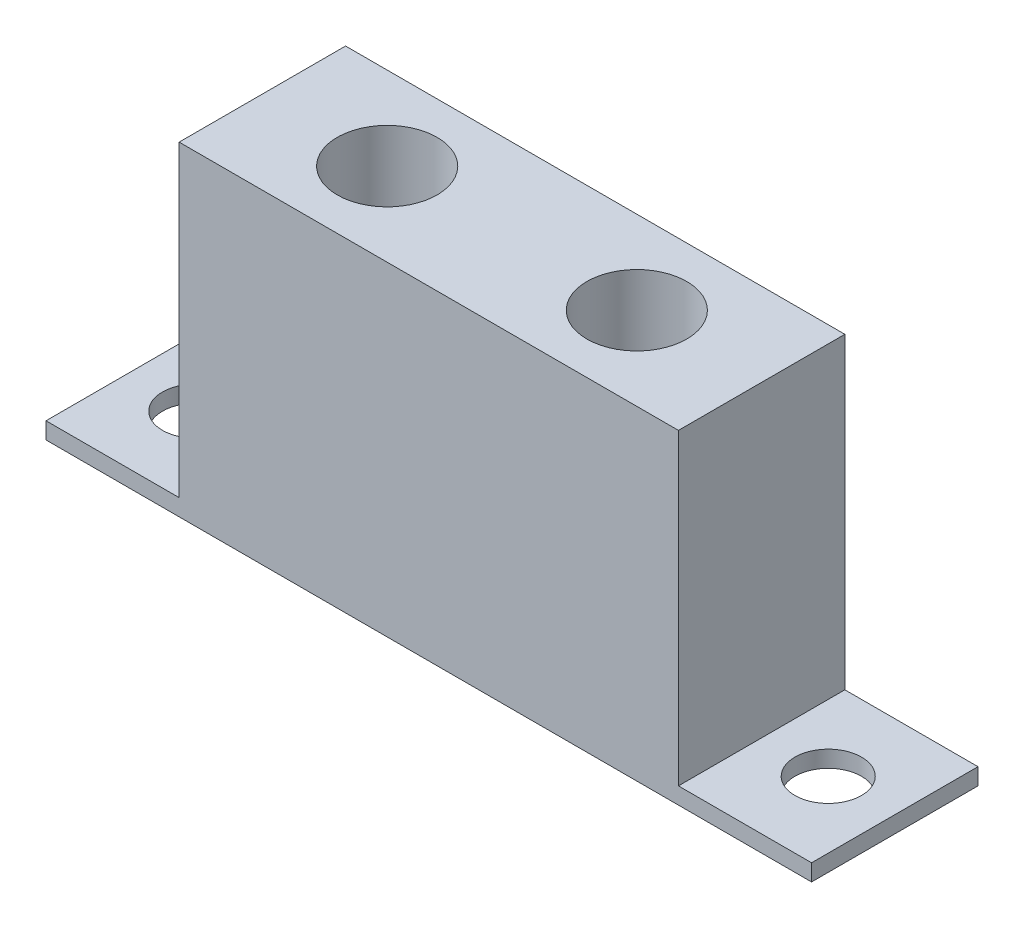
ISO-10303-21;
HEADER;
FILE_DESCRIPTION(('STEP AP214'),'2;1');
FILE_NAME('part.step','',(''),(''),'','','');
FILE_SCHEMA(('AUTOMOTIVE_DESIGN { 1 0 10303 214 1 1 1 1 }'));
ENDSEC;
DATA;
#1=APPLICATION_CONTEXT('core data for automotive mechanical design processes');
#2=APPLICATION_PROTOCOL_DEFINITION('international standard','automotive_design',2000,#1);
#3=PRODUCT_CONTEXT('',#1,'mechanical');
#4=PRODUCT('Part','Part','',(#3));
#5=PRODUCT_RELATED_PRODUCT_CATEGORY('part','',(#4));
#6=PRODUCT_DEFINITION_FORMATION('','',#4);
#7=PRODUCT_DEFINITION_CONTEXT('part definition',#1,'design');
#8=PRODUCT_DEFINITION('design','',#6,#7);
#9=PRODUCT_DEFINITION_SHAPE('','',#8);
#10=(LENGTH_UNIT() NAMED_UNIT(*) SI_UNIT(.MILLI.,.METRE.));
#11=(NAMED_UNIT(*) PLANE_ANGLE_UNIT() SI_UNIT($,.RADIAN.));
#12=(NAMED_UNIT(*) SI_UNIT($,.STERADIAN.) SOLID_ANGLE_UNIT());
#13=UNCERTAINTY_MEASURE_WITH_UNIT(LENGTH_MEASURE(1.E-05),#10,'distance_accuracy_value','');
#14=(GEOMETRIC_REPRESENTATION_CONTEXT(3) GLOBAL_UNCERTAINTY_ASSIGNED_CONTEXT((#13)) GLOBAL_UNIT_ASSIGNED_CONTEXT((#10,
#11,#12)) REPRESENTATION_CONTEXT('',''));
#15=CARTESIAN_POINT('',(0.,0.,0.));
#16=DIRECTION('',(0.,0.,1.));
#17=DIRECTION('',(1.,0.,0.));
#18=AXIS2_PLACEMENT_3D('',#15,#16,#17);
#19=CARTESIAN_POINT('',(-7.84172661870503,9.75,2.5));
#20=DIRECTION('',(1.,0.,0.));
#21=DIRECTION('',(0.,0.,-1.));
#22=AXIS2_PLACEMENT_3D('',#19,#20,#21);
#23=PLANE('',#22);
#24=DIRECTION('',(0.,0.,-1.));
#25=VECTOR('',#24,1.);
#26=CARTESIAN_POINT('',(-7.84172661870503,0.5,-2.5));
#27=LINE('',#26,#25);
#28=CARTESIAN_POINT('',(-7.84172661870503,0.5,2.5));
#29=VERTEX_POINT('',#28);
#30=CARTESIAN_POINT('',(-7.84172661870503,0.5,-2.5));
#31=VERTEX_POINT('',#30);
#32=EDGE_CURVE('E58',#29,#31,#27,.T.);
#33=ORIENTED_EDGE('',*,*,#32,.F.);
#34=DIRECTION('',(0.,-1.,0.));
#35=VECTOR('',#34,1.);
#36=CARTESIAN_POINT('',(-7.84172661870503,9.75,2.5));
#37=LINE('',#36,#35);
#38=CARTESIAN_POINT('',(-7.84172661870503,9.75,2.5));
#39=VERTEX_POINT('',#38);
#40=EDGE_CURVE('E185',#39,#29,#37,.T.);
#41=ORIENTED_EDGE('',*,*,#40,.F.);
#42=DIRECTION('',(0.,0.,1.));
#43=VECTOR('',#42,1.);
#44=CARTESIAN_POINT('',(-7.84172661870503,9.75,2.5));
#45=LINE('',#44,#43);
#46=CARTESIAN_POINT('',(-7.84172661870503,9.75,-2.5));
#47=VERTEX_POINT('',#46);
#48=EDGE_CURVE('E178',#47,#39,#45,.T.);
#49=ORIENTED_EDGE('',*,*,#48,.F.);
#50=DIRECTION('',(0.,-1.,0.));
#51=VECTOR('',#50,1.);
#52=CARTESIAN_POINT('',(-7.84172661870503,9.75,-2.5));
#53=LINE('',#52,#51);
#54=EDGE_CURVE('E51',#47,#31,#53,.T.);
#55=ORIENTED_EDGE('',*,*,#54,.T.);
#56=EDGE_LOOP('',(#33,#41,#49,#55));
#57=FACE_BOUND('',#56,.T.);
#58=ADVANCED_FACE('F43',(#57),#23,.F.);
#59=CARTESIAN_POINT('',(7.15827338129497,9.75,2.5));
#60=DIRECTION('',(-1.,0.,0.));
#61=DIRECTION('',(0.,0.,1.));
#62=AXIS2_PLACEMENT_3D('',#59,#60,#61);
#63=PLANE('',#62);
#64=DIRECTION('',(0.,0.,1.));
#65=VECTOR('',#64,1.);
#66=CARTESIAN_POINT('',(7.15827338129497,0.5,2.5));
#67=LINE('',#66,#65);
#68=CARTESIAN_POINT('',(7.15827338129497,0.5,-2.5));
#69=VERTEX_POINT('',#68);
#70=CARTESIAN_POINT('',(7.15827338129497,0.5,2.5));
#71=VERTEX_POINT('',#70);
#72=EDGE_CURVE('E66',#69,#71,#67,.T.);
#73=ORIENTED_EDGE('',*,*,#72,.F.);
#74=DIRECTION('',(0.,-1.,0.));
#75=VECTOR('',#74,1.);
#76=CARTESIAN_POINT('',(7.15827338129497,9.75,-2.5));
#77=LINE('',#76,#75);
#78=CARTESIAN_POINT('',(7.15827338129497,9.75,-2.5));
#79=VERTEX_POINT('',#78);
#80=EDGE_CURVE('E11',#79,#69,#77,.T.);
#81=ORIENTED_EDGE('',*,*,#80,.F.);
#82=DIRECTION('',(0.,0.,-1.));
#83=VECTOR('',#82,1.);
#84=CARTESIAN_POINT('',(7.15827338129497,9.75,2.5));
#85=LINE('',#84,#83);
#86=CARTESIAN_POINT('',(7.15827338129497,9.75,2.5));
#87=VERTEX_POINT('',#86);
#88=EDGE_CURVE('E173',#87,#79,#85,.T.);
#89=ORIENTED_EDGE('',*,*,#88,.F.);
#90=DIRECTION('',(0.,-1.,0.));
#91=VECTOR('',#90,1.);
#92=CARTESIAN_POINT('',(7.15827338129497,9.75,2.5));
#93=LINE('',#92,#91);
#94=EDGE_CURVE('E181',#87,#71,#93,.T.);
#95=ORIENTED_EDGE('',*,*,#94,.T.);
#96=EDGE_LOOP('',(#73,#81,#89,#95));
#97=FACE_BOUND('',#96,.T.);
#98=ADVANCED_FACE('F45',(#97),#63,.F.);
#99=CARTESIAN_POINT('',(-7.84172661870503,9.75,-2.5));
#100=DIRECTION('',(0.,0.,1.));
#101=DIRECTION('',(1.,0.,0.));
#102=AXIS2_PLACEMENT_3D('',#99,#100,#101);
#103=PLANE('',#102);
#104=DIRECTION('',(-1.,0.,0.));
#105=VECTOR('',#104,1.);
#106=CARTESIAN_POINT('',(-7.84172661870503,0.,-2.5));
#107=LINE('',#106,#105);
#108=CARTESIAN_POINT('',(11.158273381295,0.,-2.5));
#109=VERTEX_POINT('',#108);
#110=CARTESIAN_POINT('',(-11.841726618705,0.,-2.5));
#111=VERTEX_POINT('',#110);
#112=EDGE_CURVE('E109',#109,#111,#107,.T.);
#113=ORIENTED_EDGE('',*,*,#112,.T.);
#114=DIRECTION('',(0.,-1.,0.));
#115=VECTOR('',#114,1.);
#116=CARTESIAN_POINT('',(-11.841726618705,0.,-2.5));
#117=LINE('',#116,#115);
#118=CARTESIAN_POINT('',(-11.841726618705,0.5,-2.5));
#119=VERTEX_POINT('',#118);
#120=EDGE_CURVE('E114',#119,#111,#117,.T.);
#121=ORIENTED_EDGE('',*,*,#120,.F.);
#122=DIRECTION('',(1.,0.,0.));
#123=VECTOR('',#122,1.);
#124=CARTESIAN_POINT('',(-11.841726618705,0.5,-2.5));
#125=LINE('',#124,#123);
#126=EDGE_CURVE('E141',#119,#31,#125,.T.);
#127=ORIENTED_EDGE('',*,*,#126,.T.);
#128=ORIENTED_EDGE('',*,*,#54,.F.);
#129=DIRECTION('',(-1.,0.,0.));
#130=VECTOR('',#129,1.);
#131=CARTESIAN_POINT('',(-7.84172661870503,9.75,-2.5));
#132=LINE('',#131,#130);
#133=EDGE_CURVE('E176',#79,#47,#132,.T.);
#134=ORIENTED_EDGE('',*,*,#133,.F.);
#135=ORIENTED_EDGE('',*,*,#80,.T.);
#136=DIRECTION('',(-1.,0.,0.));
#137=VECTOR('',#136,1.);
#138=CARTESIAN_POINT('',(11.158273381295,0.5,-2.5));
#139=LINE('',#138,#137);
#140=CARTESIAN_POINT('',(11.158273381295,0.5,-2.5));
#141=VERTEX_POINT('',#140);
#142=EDGE_CURVE('E159',#141,#69,#139,.T.);
#143=ORIENTED_EDGE('',*,*,#142,.F.);
#144=DIRECTION('',(0.,1.,0.));
#145=VECTOR('',#144,1.);
#146=CARTESIAN_POINT('',(11.158273381295,0.,-2.5));
#147=LINE('',#146,#145);
#148=EDGE_CURVE('E116',#109,#141,#147,.T.);
#149=ORIENTED_EDGE('',*,*,#148,.F.);
#150=EDGE_LOOP('',(#113,#121,#127,#128,#134,#135,#143,#149));
#151=FACE_BOUND('',#150,.T.);
#152=ADVANCED_FACE('F111',(#151),#103,.F.);
#153=CARTESIAN_POINT('',(-7.84172661870503,9.75,2.5));
#154=DIRECTION('',(0.,0.,-1.));
#155=DIRECTION('',(-1.,0.,0.));
#156=AXIS2_PLACEMENT_3D('',#153,#154,#155);
#157=PLANE('',#156);
#158=DIRECTION('',(1.,0.,0.));
#159=VECTOR('',#158,1.);
#160=CARTESIAN_POINT('',(-7.84172661870503,0.,2.5));
#161=LINE('',#160,#159);
#162=CARTESIAN_POINT('',(-11.841726618705,0.,2.5));
#163=VERTEX_POINT('',#162);
#164=CARTESIAN_POINT('',(11.158273381295,0.,2.5));
#165=VERTEX_POINT('',#164);
#166=EDGE_CURVE('E120',#163,#165,#161,.T.);
#167=ORIENTED_EDGE('',*,*,#166,.T.);
#168=DIRECTION('',(0.,-1.,0.));
#169=VECTOR('',#168,1.);
#170=CARTESIAN_POINT('',(11.158273381295,0.,2.5));
#171=LINE('',#170,#169);
#172=CARTESIAN_POINT('',(11.158273381295,0.5,2.5));
#173=VERTEX_POINT('',#172);
#174=EDGE_CURVE('E147',#173,#165,#171,.T.);
#175=ORIENTED_EDGE('',*,*,#174,.F.);
#176=DIRECTION('',(-1.,0.,0.));
#177=VECTOR('',#176,1.);
#178=CARTESIAN_POINT('',(11.158273381295,0.5,2.5));
#179=LINE('',#178,#177);
#180=EDGE_CURVE('E155',#173,#71,#179,.T.);
#181=ORIENTED_EDGE('',*,*,#180,.T.);
#182=ORIENTED_EDGE('',*,*,#94,.F.);
#183=DIRECTION('',(1.,0.,0.));
#184=VECTOR('',#183,1.);
#185=CARTESIAN_POINT('',(-7.84172661870503,9.75,2.5));
#186=LINE('',#185,#184);
#187=EDGE_CURVE('E180',#39,#87,#186,.T.);
#188=ORIENTED_EDGE('',*,*,#187,.F.);
#189=ORIENTED_EDGE('',*,*,#40,.T.);
#190=DIRECTION('',(1.,0.,0.));
#191=VECTOR('',#190,1.);
#192=CARTESIAN_POINT('',(-11.841726618705,0.5,2.5));
#193=LINE('',#192,#191);
#194=CARTESIAN_POINT('',(-11.841726618705,0.5,2.5));
#195=VERTEX_POINT('',#194);
#196=EDGE_CURVE('E144',#195,#29,#193,.T.);
#197=ORIENTED_EDGE('',*,*,#196,.F.);
#198=DIRECTION('',(0.,1.,0.));
#199=VECTOR('',#198,1.);
#200=CARTESIAN_POINT('',(-11.841726618705,0.,2.5));
#201=LINE('',#200,#199);
#202=EDGE_CURVE('E128',#163,#195,#201,.T.);
#203=ORIENTED_EDGE('',*,*,#202,.F.);
#204=EDGE_LOOP('',(#167,#175,#181,#182,#188,#189,#197,#203));
#205=FACE_BOUND('',#204,.T.);
#206=ADVANCED_FACE('F192',(#205),#157,.F.);
#207=CARTESIAN_POINT('',(0.,9.75,0.));
#208=DIRECTION('',(0.,-1.,0.));
#209=DIRECTION('',(0.,0.,-1.));
#210=AXIS2_PLACEMENT_3D('',#207,#208,#209);
#211=PLANE('',#210);
#212=CARTESIAN_POINT('',(-4.09172661870503,9.75,0.));
#213=DIRECTION('',(0.,1.,0.));
#214=DIRECTION('',(0.,0.,1.));
#215=AXIS2_PLACEMENT_3D('',#212,#213,#214);
#216=CIRCLE('',#215,1.5);
#217=CARTESIAN_POINT('',(-4.09172661870503,9.75,1.5));
#218=VERTEX_POINT('',#217);
#219=EDGE_CURVE('E165',#218,#218,#216,.T.);
#220=ORIENTED_EDGE('',*,*,#219,.F.);
#221=EDGE_LOOP('',(#220));
#222=FACE_BOUND('',#221,.T.);
#223=CARTESIAN_POINT('',(3.40827338129497,9.75,0.));
#224=DIRECTION('',(0.,1.,0.));
#225=DIRECTION('',(0.,0.,1.));
#226=AXIS2_PLACEMENT_3D('',#223,#224,#225);
#227=CIRCLE('',#226,1.5);
#228=CARTESIAN_POINT('',(3.40827338129497,9.75,1.5));
#229=VERTEX_POINT('',#228);
#230=EDGE_CURVE('E168',#229,#229,#227,.T.);
#231=ORIENTED_EDGE('',*,*,#230,.F.);
#232=EDGE_LOOP('',(#231));
#233=FACE_BOUND('',#232,.T.);
#234=ORIENTED_EDGE('',*,*,#88,.T.);
#235=ORIENTED_EDGE('',*,*,#133,.T.);
#236=ORIENTED_EDGE('',*,*,#48,.T.);
#237=ORIENTED_EDGE('',*,*,#187,.T.);
#238=EDGE_LOOP('',(#234,#235,#236,#237));
#239=FACE_BOUND('',#238,.T.);
#240=ADVANCED_FACE('F197',(#222,#233,#239),#211,.F.);
#241=CARTESIAN_POINT('',(0.,0.,0.));
#242=DIRECTION('',(0.,-1.,0.));
#243=DIRECTION('',(0.,0.,-1.));
#244=AXIS2_PLACEMENT_3D('',#241,#242,#243);
#245=PLANE('',#244);
#246=CARTESIAN_POINT('',(-9.84172661870503,0.,0.));
#247=DIRECTION('',(0.,-1.,0.));
#248=DIRECTION('',(0.,0.,-1.));
#249=AXIS2_PLACEMENT_3D('',#246,#247,#248);
#250=CIRCLE('',#249,1.);
#251=CARTESIAN_POINT('',(-9.84172661870503,0.,-1.));
#252=VERTEX_POINT('',#251);
#253=EDGE_CURVE('E410',#252,#252,#250,.T.);
#254=ORIENTED_EDGE('',*,*,#253,.F.);
#255=EDGE_LOOP('',(#254));
#256=FACE_BOUND('',#255,.T.);
#257=CARTESIAN_POINT('',(9.15827338129497,0.,0.));
#258=DIRECTION('',(0.,-1.,0.));
#259=DIRECTION('',(0.,0.,-1.));
#260=AXIS2_PLACEMENT_3D('',#257,#258,#259);
#261=CIRCLE('',#260,1.);
#262=CARTESIAN_POINT('',(9.15827338129497,0.,-1.));
#263=VERTEX_POINT('',#262);
#264=EDGE_CURVE('E135',#263,#263,#261,.T.);
#265=ORIENTED_EDGE('',*,*,#264,.F.);
#266=EDGE_LOOP('',(#265));
#267=FACE_BOUND('',#266,.T.);
#268=ORIENTED_EDGE('',*,*,#112,.F.);
#269=DIRECTION('',(0.,0.,-1.));
#270=VECTOR('',#269,1.);
#271=CARTESIAN_POINT('',(11.158273381295,0.,2.5));
#272=LINE('',#271,#270);
#273=EDGE_CURVE('E150',#165,#109,#272,.T.);
#274=ORIENTED_EDGE('',*,*,#273,.F.);
#275=ORIENTED_EDGE('',*,*,#166,.F.);
#276=DIRECTION('',(0.,0.,1.));
#277=VECTOR('',#276,1.);
#278=CARTESIAN_POINT('',(-11.841726618705,0.,-2.5));
#279=LINE('',#278,#277);
#280=EDGE_CURVE('E124',#111,#163,#279,.T.);
#281=ORIENTED_EDGE('',*,*,#280,.F.);
#282=EDGE_LOOP('',(#268,#274,#275,#281));
#283=FACE_BOUND('',#282,.T.);
#284=ADVANCED_FACE('F125',(#256,#267,#283),#245,.T.);
#285=CARTESIAN_POINT('',(3.40827338129497,5.75,0.));
#286=DIRECTION('',(0.,1.,0.));
#287=DIRECTION('',(0.,0.,1.));
#288=AXIS2_PLACEMENT_3D('',#285,#286,#287);
#289=CYLINDRICAL_SURFACE('',#288,1.5);
#290=CARTESIAN_POINT('',(3.40827338129497,5.75,0.));
#291=DIRECTION('',(0.,1.,0.));
#292=DIRECTION('',(0.,0.,1.));
#293=AXIS2_PLACEMENT_3D('',#290,#291,#292);
#294=CIRCLE('',#293,1.5);
#295=CARTESIAN_POINT('',(3.40827338129497,5.75,1.5));
#296=VERTEX_POINT('',#295);
#297=EDGE_CURVE('E162',#296,#296,#294,.T.);
#298=ORIENTED_EDGE('',*,*,#297,.F.);
#299=EDGE_LOOP('',(#298));
#300=FACE_BOUND('',#299,.T.);
#301=ORIENTED_EDGE('',*,*,#230,.T.);
#302=EDGE_LOOP('',(#301));
#303=FACE_BOUND('',#302,.T.);
#304=ADVANCED_FACE('F235',(#300,#303),#289,.F.);
#305=CARTESIAN_POINT('',(3.40827338129497,5.75,0.));
#306=DIRECTION('',(0.,1.,0.));
#307=DIRECTION('',(0.,0.,1.));
#308=AXIS2_PLACEMENT_3D('',#305,#306,#307);
#309=PLANE('',#308);
#310=ORIENTED_EDGE('',*,*,#297,.T.);
#311=EDGE_LOOP('',(#310));
#312=FACE_BOUND('',#311,.T.);
#313=ADVANCED_FACE('F240',(#312),#309,.T.);
#314=CARTESIAN_POINT('',(-4.09172661870503,5.75,0.));
#315=DIRECTION('',(0.,1.,0.));
#316=DIRECTION('',(0.,0.,1.));
#317=AXIS2_PLACEMENT_3D('',#314,#315,#316);
#318=CYLINDRICAL_SURFACE('',#317,1.5);
#319=CARTESIAN_POINT('',(-4.09172661870503,5.75,0.));
#320=DIRECTION('',(0.,1.,0.));
#321=DIRECTION('',(0.,0.,1.));
#322=AXIS2_PLACEMENT_3D('',#319,#320,#321);
#323=CIRCLE('',#322,1.5);
#324=CARTESIAN_POINT('',(-4.09172661870503,5.75,1.5));
#325=VERTEX_POINT('',#324);
#326=EDGE_CURVE('E121',#325,#325,#323,.T.);
#327=ORIENTED_EDGE('',*,*,#326,.F.);
#328=EDGE_LOOP('',(#327));
#329=FACE_BOUND('',#328,.T.);
#330=ORIENTED_EDGE('',*,*,#219,.T.);
#331=EDGE_LOOP('',(#330));
#332=FACE_BOUND('',#331,.T.);
#333=ADVANCED_FACE('F243',(#329,#332),#318,.F.);
#334=CARTESIAN_POINT('',(-4.09172661870503,5.75,0.));
#335=DIRECTION('',(0.,1.,0.));
#336=DIRECTION('',(0.,0.,1.));
#337=AXIS2_PLACEMENT_3D('',#334,#335,#336);
#338=PLANE('',#337);
#339=ORIENTED_EDGE('',*,*,#326,.T.);
#340=EDGE_LOOP('',(#339));
#341=FACE_BOUND('',#340,.T.);
#342=ADVANCED_FACE('F213',(#341),#338,.T.);
#343=CARTESIAN_POINT('',(11.158273381295,0.5,2.5));
#344=DIRECTION('',(0.,-1.,0.));
#345=DIRECTION('',(0.,0.,-1.));
#346=AXIS2_PLACEMENT_3D('',#343,#344,#345);
#347=PLANE('',#346);
#348=CARTESIAN_POINT('',(9.15827338129497,0.5,0.));
#349=DIRECTION('',(0.,1.,0.));
#350=DIRECTION('',(0.,0.,1.));
#351=AXIS2_PLACEMENT_3D('',#348,#349,#350);
#352=CIRCLE('',#351,1.);
#353=CARTESIAN_POINT('',(9.15827338129497,0.5,1.));
#354=VERTEX_POINT('',#353);
#355=EDGE_CURVE('E406',#354,#354,#352,.T.);
#356=ORIENTED_EDGE('',*,*,#355,.F.);
#357=EDGE_LOOP('',(#356));
#358=FACE_BOUND('',#357,.T.);
#359=ORIENTED_EDGE('',*,*,#72,.T.);
#360=ORIENTED_EDGE('',*,*,#180,.F.);
#361=DIRECTION('',(0.,0.,1.));
#362=VECTOR('',#361,1.);
#363=CARTESIAN_POINT('',(11.158273381295,0.5,2.5));
#364=LINE('',#363,#362);
#365=EDGE_CURVE('E153',#141,#173,#364,.T.);
#366=ORIENTED_EDGE('',*,*,#365,.F.);
#367=ORIENTED_EDGE('',*,*,#142,.T.);
#368=EDGE_LOOP('',(#359,#360,#366,#367));
#369=FACE_BOUND('',#368,.T.);
#370=ADVANCED_FACE('F200',(#358,#369),#347,.F.);
#371=CARTESIAN_POINT('',(11.158273381295,0.,0.));
#372=DIRECTION('',(-1.,0.,0.));
#373=DIRECTION('',(0.,0.,1.));
#374=AXIS2_PLACEMENT_3D('',#371,#372,#373);
#375=PLANE('',#374);
#376=ORIENTED_EDGE('',*,*,#174,.T.);
#377=ORIENTED_EDGE('',*,*,#273,.T.);
#378=ORIENTED_EDGE('',*,*,#148,.T.);
#379=ORIENTED_EDGE('',*,*,#365,.T.);
#380=EDGE_LOOP('',(#376,#377,#378,#379));
#381=FACE_BOUND('',#380,.T.);
#382=ADVANCED_FACE('F204',(#381),#375,.F.);
#383=CARTESIAN_POINT('',(-11.841726618705,0.5,-2.5));
#384=DIRECTION('',(0.,-1.,0.));
#385=DIRECTION('',(0.,0.,-1.));
#386=AXIS2_PLACEMENT_3D('',#383,#384,#385);
#387=PLANE('',#386);
#388=CARTESIAN_POINT('',(-9.84172661870503,0.5,0.));
#389=DIRECTION('',(0.,1.,0.));
#390=DIRECTION('',(0.,0.,1.));
#391=AXIS2_PLACEMENT_3D('',#388,#389,#390);
#392=CIRCLE('',#391,1.);
#393=CARTESIAN_POINT('',(-9.84172661870503,0.5,1.));
#394=VERTEX_POINT('',#393);
#395=EDGE_CURVE('E407',#394,#394,#392,.T.);
#396=ORIENTED_EDGE('',*,*,#395,.F.);
#397=EDGE_LOOP('',(#396));
#398=FACE_BOUND('',#397,.T.);
#399=ORIENTED_EDGE('',*,*,#32,.T.);
#400=ORIENTED_EDGE('',*,*,#126,.F.);
#401=DIRECTION('',(0.,0.,-1.));
#402=VECTOR('',#401,1.);
#403=CARTESIAN_POINT('',(-11.841726618705,0.5,-2.5));
#404=LINE('',#403,#402);
#405=EDGE_CURVE('E132',#195,#119,#404,.T.);
#406=ORIENTED_EDGE('',*,*,#405,.F.);
#407=ORIENTED_EDGE('',*,*,#196,.T.);
#408=EDGE_LOOP('',(#399,#400,#406,#407));
#409=FACE_BOUND('',#408,.T.);
#410=ADVANCED_FACE('F189',(#398,#409),#387,.F.);
#411=CARTESIAN_POINT('',(-11.841726618705,0.,0.));
#412=DIRECTION('',(1.,0.,0.));
#413=DIRECTION('',(0.,0.,-1.));
#414=AXIS2_PLACEMENT_3D('',#411,#412,#413);
#415=PLANE('',#414);
#416=ORIENTED_EDGE('',*,*,#120,.T.);
#417=ORIENTED_EDGE('',*,*,#280,.T.);
#418=ORIENTED_EDGE('',*,*,#202,.T.);
#419=ORIENTED_EDGE('',*,*,#405,.T.);
#420=EDGE_LOOP('',(#416,#417,#418,#419));
#421=FACE_BOUND('',#420,.T.);
#422=ADVANCED_FACE('F130',(#421),#415,.F.);
#423=CARTESIAN_POINT('',(-9.84172661870503,-3.5,0.));
#424=DIRECTION('',(0.,1.,0.));
#425=DIRECTION('',(0.,0.,1.));
#426=AXIS2_PLACEMENT_3D('',#423,#424,#425);
#427=CYLINDRICAL_SURFACE('',#426,1.);
#428=ORIENTED_EDGE('',*,*,#253,.T.);
#429=EDGE_LOOP('',(#428));
#430=FACE_BOUND('',#429,.T.);
#431=ORIENTED_EDGE('',*,*,#395,.T.);
#432=EDGE_LOOP('',(#431));
#433=FACE_BOUND('',#432,.T.);
#434=ADVANCED_FACE('F285',(#430,#433),#427,.F.);
#435=CARTESIAN_POINT('',(9.15827338129497,-3.5,0.));
#436=DIRECTION('',(0.,1.,0.));
#437=DIRECTION('',(0.,0.,1.));
#438=AXIS2_PLACEMENT_3D('',#435,#436,#437);
#439=CYLINDRICAL_SURFACE('',#438,1.);
#440=ORIENTED_EDGE('',*,*,#264,.T.);
#441=EDGE_LOOP('',(#440));
#442=FACE_BOUND('',#441,.T.);
#443=ORIENTED_EDGE('',*,*,#355,.T.);
#444=EDGE_LOOP('',(#443));
#445=FACE_BOUND('',#444,.T.);
#446=ADVANCED_FACE('F290',(#442,#445),#439,.F.);
#447=CLOSED_SHELL('',(#58,#98,#152,#206,#240,#284,#304,#313,#333,#342,#370,#382,#410,#422,#434,#446));
#448=MANIFOLD_SOLID_BREP('B2',#447);
#449=ADVANCED_BREP_SHAPE_REPRESENTATION('',(#18,#448),#14);
#450=SHAPE_DEFINITION_REPRESENTATION(#9,#449);
ENDSEC;
END-ISO-10303-21;
